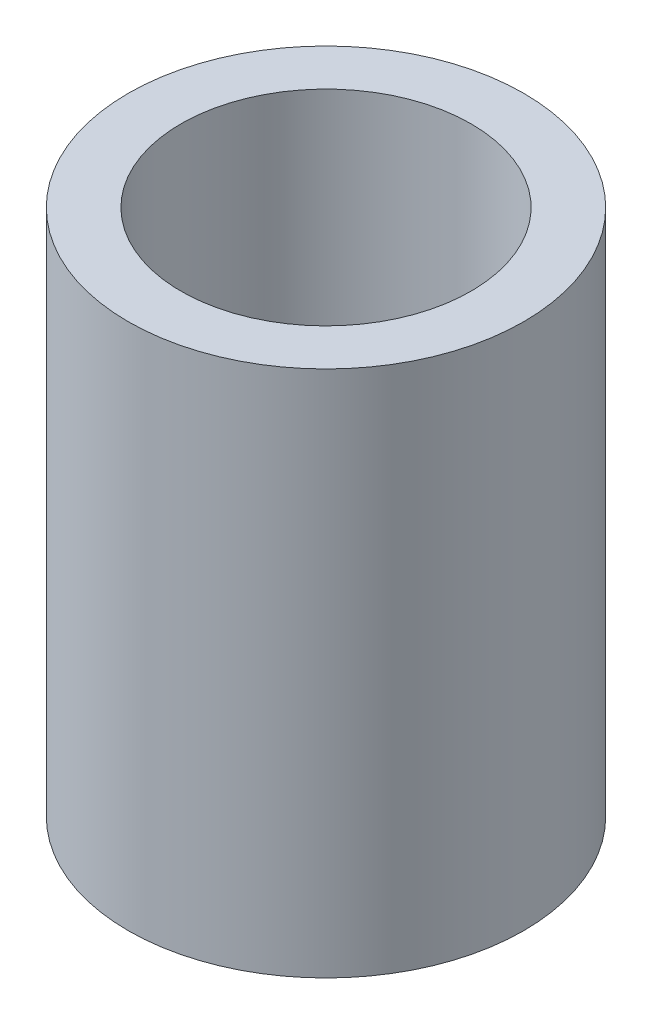
ISO-10303-21;
HEADER;
FILE_DESCRIPTION(('STEP AP214'),'2;1');
FILE_NAME('part.step','',(''),(''),'','','');
FILE_SCHEMA(('AUTOMOTIVE_DESIGN { 1 0 10303 214 1 1 1 1 }'));
ENDSEC;
DATA;
#1=APPLICATION_CONTEXT('core data for automotive mechanical design processes');
#2=APPLICATION_PROTOCOL_DEFINITION('international standard','automotive_design',2000,#1);
#3=PRODUCT_CONTEXT('',#1,'mechanical');
#4=PRODUCT('Part','Part','',(#3));
#5=PRODUCT_RELATED_PRODUCT_CATEGORY('part','',(#4));
#6=PRODUCT_DEFINITION_FORMATION('','',#4);
#7=PRODUCT_DEFINITION_CONTEXT('part definition',#1,'design');
#8=PRODUCT_DEFINITION('design','',#6,#7);
#9=PRODUCT_DEFINITION_SHAPE('','',#8);
#10=(LENGTH_UNIT() NAMED_UNIT(*) SI_UNIT(.MILLI.,.METRE.));
#11=(NAMED_UNIT(*) PLANE_ANGLE_UNIT() SI_UNIT($,.RADIAN.));
#12=(NAMED_UNIT(*) SI_UNIT($,.STERADIAN.) SOLID_ANGLE_UNIT());
#13=UNCERTAINTY_MEASURE_WITH_UNIT(LENGTH_MEASURE(1.E-05),#10,'distance_accuracy_value','');
#14=(GEOMETRIC_REPRESENTATION_CONTEXT(3) GLOBAL_UNCERTAINTY_ASSIGNED_CONTEXT((#13)) GLOBAL_UNIT_ASSIGNED_CONTEXT((#10,
#11,#12)) REPRESENTATION_CONTEXT('',''));
#15=CARTESIAN_POINT('',(0.,0.,0.));
#16=DIRECTION('',(0.,0.,1.));
#17=DIRECTION('',(1.,0.,0.));
#18=AXIS2_PLACEMENT_3D('',#15,#16,#17);
#19=CARTESIAN_POINT('',(0.,0.,0.));
#20=DIRECTION('',(0.,-1.,0.));
#21=DIRECTION('',(0.,0.,-1.));
#22=AXIS2_PLACEMENT_3D('',#19,#20,#21);
#23=CYLINDRICAL_SURFACE('',#22,1.1);
#24=CARTESIAN_POINT('',(0.,0.,0.));
#25=DIRECTION('',(0.,-1.,0.));
#26=DIRECTION('',(0.,0.,-1.));
#27=AXIS2_PLACEMENT_3D('',#24,#25,#26);
#28=CIRCLE('',#27,1.1);
#29=CARTESIAN_POINT('',(0.,0.,-1.1));
#30=VERTEX_POINT('',#29);
#31=EDGE_CURVE('E43',#30,#30,#28,.T.);
#32=ORIENTED_EDGE('',*,*,#31,.T.);
#33=EDGE_LOOP('',(#32));
#34=FACE_BOUND('',#33,.T.);
#35=CARTESIAN_POINT('',(0.,4.,0.));
#36=DIRECTION('',(0.,-1.,0.));
#37=DIRECTION('',(0.,0.,-1.));
#38=AXIS2_PLACEMENT_3D('',#35,#36,#37);
#39=CIRCLE('',#38,1.1);
#40=CARTESIAN_POINT('',(0.,4.,-1.1));
#41=VERTEX_POINT('',#40);
#42=EDGE_CURVE('E10',#41,#41,#39,.T.);
#43=ORIENTED_EDGE('',*,*,#42,.F.);
#44=EDGE_LOOP('',(#43));
#45=FACE_BOUND('',#44,.T.);
#46=ADVANCED_FACE('F29',(#34,#45),#23,.F.);
#47=CARTESIAN_POINT('',(1.1,4.,0.));
#48=DIRECTION('',(0.,1.,0.));
#49=DIRECTION('',(0.,0.,1.));
#50=AXIS2_PLACEMENT_3D('',#47,#48,#49);
#51=PLANE('',#50);
#52=ORIENTED_EDGE('',*,*,#42,.T.);
#53=EDGE_LOOP('',(#52));
#54=FACE_BOUND('',#53,.T.);
#55=CARTESIAN_POINT('',(0.,4.,0.));
#56=DIRECTION('',(0.,-1.,0.));
#57=DIRECTION('',(0.,0.,-1.));
#58=AXIS2_PLACEMENT_3D('',#55,#56,#57);
#59=CIRCLE('',#58,1.5);
#60=CARTESIAN_POINT('',(0.,4.,-1.5));
#61=VERTEX_POINT('',#60);
#62=EDGE_CURVE('E35',#61,#61,#59,.T.);
#63=ORIENTED_EDGE('',*,*,#62,.F.);
#64=EDGE_LOOP('',(#63));
#65=FACE_BOUND('',#64,.T.);
#66=ADVANCED_FACE('F59',(#54,#65),#51,.T.);
#67=CARTESIAN_POINT('',(0.,0.,0.));
#68=DIRECTION('',(0.,-1.,0.));
#69=DIRECTION('',(0.,0.,-1.));
#70=AXIS2_PLACEMENT_3D('',#67,#68,#69);
#71=CYLINDRICAL_SURFACE('',#70,1.5);
#72=ORIENTED_EDGE('',*,*,#62,.T.);
#73=EDGE_LOOP('',(#72));
#74=FACE_BOUND('',#73,.T.);
#75=CARTESIAN_POINT('',(0.,0.,0.));
#76=DIRECTION('',(0.,-1.,0.));
#77=DIRECTION('',(0.,0.,-1.));
#78=AXIS2_PLACEMENT_3D('',#75,#76,#77);
#79=CIRCLE('',#78,1.5);
#80=CARTESIAN_POINT('',(0.,0.,-1.5));
#81=VERTEX_POINT('',#80);
#82=EDGE_CURVE('E39',#81,#81,#79,.T.);
#83=ORIENTED_EDGE('',*,*,#82,.F.);
#84=EDGE_LOOP('',(#83));
#85=FACE_BOUND('',#84,.T.);
#86=ADVANCED_FACE('F53',(#74,#85),#71,.T.);
#87=CARTESIAN_POINT('',(1.1,0.,0.));
#88=DIRECTION('',(0.,-1.,0.));
#89=DIRECTION('',(0.,0.,-1.));
#90=AXIS2_PLACEMENT_3D('',#87,#88,#89);
#91=PLANE('',#90);
#92=ORIENTED_EDGE('',*,*,#82,.T.);
#93=EDGE_LOOP('',(#92));
#94=FACE_BOUND('',#93,.T.);
#95=ORIENTED_EDGE('',*,*,#31,.F.);
#96=EDGE_LOOP('',(#95));
#97=FACE_BOUND('',#96,.T.);
#98=ADVANCED_FACE('F51',(#94,#97),#91,.T.);
#99=CLOSED_SHELL('',(#46,#66,#86,#98));
#100=MANIFOLD_SOLID_BREP('B2',#99);
#101=ADVANCED_BREP_SHAPE_REPRESENTATION('',(#18,#100),#14);
#102=SHAPE_DEFINITION_REPRESENTATION(#9,#101);
ENDSEC;
END-ISO-10303-21;
